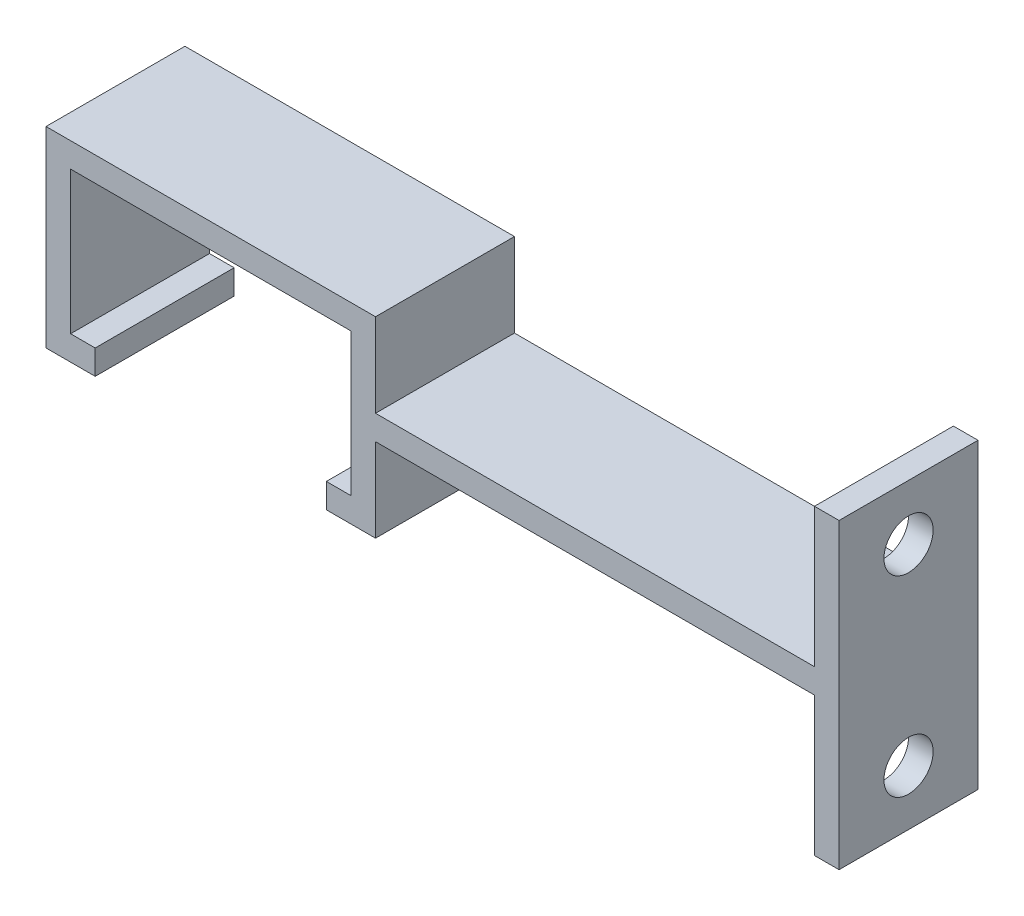
ISO-10303-21;
HEADER;
FILE_DESCRIPTION(('STEP AP214'),'2;1');
FILE_NAME('part.step','',(''),(''),'','','');
FILE_SCHEMA(('AUTOMOTIVE_DESIGN { 1 0 10303 214 1 1 1 1 }'));
ENDSEC;
DATA;
#1=APPLICATION_CONTEXT('core data for automotive mechanical design processes');
#2=APPLICATION_PROTOCOL_DEFINITION('international standard','automotive_design',2000,#1);
#3=PRODUCT_CONTEXT('',#1,'mechanical');
#4=PRODUCT('Part','Part','',(#3));
#5=PRODUCT_RELATED_PRODUCT_CATEGORY('part','',(#4));
#6=PRODUCT_DEFINITION_FORMATION('','',#4);
#7=PRODUCT_DEFINITION_CONTEXT('part definition',#1,'design');
#8=PRODUCT_DEFINITION('design','',#6,#7);
#9=PRODUCT_DEFINITION_SHAPE('','',#8);
#10=(LENGTH_UNIT() NAMED_UNIT(*) SI_UNIT(.MILLI.,.METRE.));
#11=(NAMED_UNIT(*) PLANE_ANGLE_UNIT() SI_UNIT($,.RADIAN.));
#12=(NAMED_UNIT(*) SI_UNIT($,.STERADIAN.) SOLID_ANGLE_UNIT());
#13=UNCERTAINTY_MEASURE_WITH_UNIT(LENGTH_MEASURE(1.E-05),#10,'distance_accuracy_value','');
#14=(GEOMETRIC_REPRESENTATION_CONTEXT(3) GLOBAL_UNCERTAINTY_ASSIGNED_CONTEXT((#13)) GLOBAL_UNIT_ASSIGNED_CONTEXT((#10,
#11,#12)) REPRESENTATION_CONTEXT('',''));
#15=CARTESIAN_POINT('',(0.,0.,0.));
#16=DIRECTION('',(0.,0.,1.));
#17=DIRECTION('',(1.,0.,0.));
#18=AXIS2_PLACEMENT_3D('',#15,#16,#17);
#19=CARTESIAN_POINT('',(0.,5.8,0.));
#20=DIRECTION('',(0.,1.,0.));
#21=DIRECTION('',(0.,0.,1.));
#22=AXIS2_PLACEMENT_3D('',#19,#20,#21);
#23=PLANE('',#22);
#24=DIRECTION('',(0.,0.,1.));
#25=VECTOR('',#24,1.);
#26=CARTESIAN_POINT('',(1.,5.8,11.3));
#27=LINE('',#26,#25);
#28=CARTESIAN_POINT('',(1.,5.8,0.));
#29=VERTEX_POINT('',#28);
#30=CARTESIAN_POINT('',(1.,5.8,11.3));
#31=VERTEX_POINT('',#30);
#32=EDGE_CURVE('E236',#29,#31,#27,.T.);
#33=ORIENTED_EDGE('',*,*,#32,.F.);
#34=DIRECTION('',(1.,0.,0.));
#35=VECTOR('',#34,1.);
#36=CARTESIAN_POINT('',(2.,5.8,0.));
#37=LINE('',#36,#35);
#38=CARTESIAN_POINT('',(36.7,5.8,0.));
#39=VERTEX_POINT('',#38);
#40=EDGE_CURVE('E187',#29,#39,#37,.T.);
#41=ORIENTED_EDGE('',*,*,#40,.T.);
#42=DIRECTION('',(0.,0.,-1.));
#43=VECTOR('',#42,1.);
#44=CARTESIAN_POINT('',(36.7,5.8,0.));
#45=LINE('',#44,#43);
#46=CARTESIAN_POINT('',(36.7,5.8,11.3));
#47=VERTEX_POINT('',#46);
#48=EDGE_CURVE('E262',#47,#39,#45,.T.);
#49=ORIENTED_EDGE('',*,*,#48,.F.);
#50=DIRECTION('',(-1.,0.,0.));
#51=VECTOR('',#50,1.);
#52=CARTESIAN_POINT('',(2.,5.8,11.3));
#53=LINE('',#52,#51);
#54=EDGE_CURVE('E63',#47,#31,#53,.T.);
#55=ORIENTED_EDGE('',*,*,#54,.T.);
#56=EDGE_LOOP('',(#33,#41,#49,#55));
#57=FACE_BOUND('',#56,.T.);
#58=ADVANCED_FACE('F38',(#57),#23,.F.);
#59=CARTESIAN_POINT('',(38.7,7.8,11.3));
#60=DIRECTION('',(0.,-1.,0.));
#61=DIRECTION('',(0.,0.,-1.));
#62=AXIS2_PLACEMENT_3D('',#59,#60,#61);
#63=PLANE('',#62);
#64=DIRECTION('',(0.,0.,1.));
#65=VECTOR('',#64,1.);
#66=CARTESIAN_POINT('',(36.7,7.8,11.3));
#67=LINE('',#66,#65);
#68=CARTESIAN_POINT('',(36.7,7.8,0.));
#69=VERTEX_POINT('',#68);
#70=CARTESIAN_POINT('',(36.7,7.8,11.3));
#71=VERTEX_POINT('',#70);
#72=EDGE_CURVE('E245',#69,#71,#67,.T.);
#73=ORIENTED_EDGE('',*,*,#72,.F.);
#74=DIRECTION('',(-1.,0.,0.));
#75=VECTOR('',#74,1.);
#76=CARTESIAN_POINT('',(38.7,7.8,0.));
#77=LINE('',#76,#75);
#78=CARTESIAN_POINT('',(1.,7.8,0.));
#79=VERTEX_POINT('',#78);
#80=EDGE_CURVE('E285',#69,#79,#77,.T.);
#81=ORIENTED_EDGE('',*,*,#80,.T.);
#82=DIRECTION('',(0.,0.,-1.));
#83=VECTOR('',#82,1.);
#84=CARTESIAN_POINT('',(1.,7.8,0.));
#85=LINE('',#84,#83);
#86=CARTESIAN_POINT('',(1.,7.8,11.3));
#87=VERTEX_POINT('',#86);
#88=EDGE_CURVE('E231',#87,#79,#85,.T.);
#89=ORIENTED_EDGE('',*,*,#88,.F.);
#90=DIRECTION('',(-1.,0.,0.));
#91=VECTOR('',#90,1.);
#92=CARTESIAN_POINT('',(38.7,7.8,11.3));
#93=LINE('',#92,#91);
#94=EDGE_CURVE('E283',#71,#87,#93,.T.);
#95=ORIENTED_EDGE('',*,*,#94,.F.);
#96=EDGE_LOOP('',(#73,#81,#89,#95));
#97=FACE_BOUND('',#96,.T.);
#98=ADVANCED_FACE('F361',(#97),#63,.F.);
#99=CARTESIAN_POINT('',(-21.8,0.999999999999997,11.3));
#100=DIRECTION('',(-1.,0.,0.));
#101=DIRECTION('',(0.,0.,1.));
#102=AXIS2_PLACEMENT_3D('',#99,#100,#101);
#103=PLANE('',#102);
#104=DIRECTION('',(0.,1.,0.));
#105=VECTOR('',#104,1.);
#106=CARTESIAN_POINT('',(-21.8,0.999999999999997,0.));
#107=LINE('',#106,#105);
#108=CARTESIAN_POINT('',(-21.8,-1.,0.));
#109=VERTEX_POINT('',#108);
#110=CARTESIAN_POINT('',(-21.8,0.999999999999997,0.));
#111=VERTEX_POINT('',#110);
#112=EDGE_CURVE('E294',#109,#111,#107,.T.);
#113=ORIENTED_EDGE('',*,*,#112,.T.);
#114=DIRECTION('',(0.,0.,-1.));
#115=VECTOR('',#114,1.);
#116=CARTESIAN_POINT('',(-21.8,0.999999999999997,11.3));
#117=LINE('',#116,#115);
#118=CARTESIAN_POINT('',(-21.8,0.999999999999997,11.3));
#119=VERTEX_POINT('',#118);
#120=EDGE_CURVE('E11',#119,#111,#117,.T.);
#121=ORIENTED_EDGE('',*,*,#120,.F.);
#122=DIRECTION('',(0.,1.,0.));
#123=VECTOR('',#122,1.);
#124=CARTESIAN_POINT('',(-21.8,0.999999999999997,11.3));
#125=LINE('',#124,#123);
#126=CARTESIAN_POINT('',(-21.8,-1.,11.3));
#127=VERTEX_POINT('',#126);
#128=EDGE_CURVE('E295',#127,#119,#125,.T.);
#129=ORIENTED_EDGE('',*,*,#128,.F.);
#130=DIRECTION('',(0.,0.,1.));
#131=VECTOR('',#130,1.);
#132=CARTESIAN_POINT('',(-21.8,-1.,0.));
#133=LINE('',#132,#131);
#134=EDGE_CURVE('E216',#109,#127,#133,.T.);
#135=ORIENTED_EDGE('',*,*,#134,.F.);
#136=EDGE_LOOP('',(#113,#121,#129,#135));
#137=FACE_BOUND('',#136,.T.);
#138=ADVANCED_FACE('F40',(#137),#103,.F.);
#139=CARTESIAN_POINT('',(-23.8,0.999999999999997,11.3));
#140=DIRECTION('',(0.,-1.,0.));
#141=DIRECTION('',(1.,0.,0.));
#142=AXIS2_PLACEMENT_3D('',#139,#140,#141);
#143=PLANE('',#142);
#144=DIRECTION('',(-1.,0.,0.));
#145=VECTOR('',#144,1.);
#146=CARTESIAN_POINT('',(-23.8,0.999999999999997,0.));
#147=LINE('',#146,#145);
#148=CARTESIAN_POINT('',(-23.8,0.999999999999997,0.));
#149=VERTEX_POINT('',#148);
#150=EDGE_CURVE('E312',#111,#149,#147,.T.);
#151=ORIENTED_EDGE('',*,*,#150,.T.);
#152=DIRECTION('',(0.,0.,-1.));
#153=VECTOR('',#152,1.);
#154=CARTESIAN_POINT('',(-23.8,0.999999999999997,11.3));
#155=LINE('',#154,#153);
#156=CARTESIAN_POINT('',(-23.8,0.999999999999997,11.3));
#157=VERTEX_POINT('',#156);
#158=EDGE_CURVE('E47',#157,#149,#155,.T.);
#159=ORIENTED_EDGE('',*,*,#158,.F.);
#160=DIRECTION('',(-1.,0.,0.));
#161=VECTOR('',#160,1.);
#162=CARTESIAN_POINT('',(-23.8,0.999999999999997,11.3));
#163=LINE('',#162,#161);
#164=EDGE_CURVE('E297',#119,#157,#163,.T.);
#165=ORIENTED_EDGE('',*,*,#164,.F.);
#166=ORIENTED_EDGE('',*,*,#120,.T.);
#167=EDGE_LOOP('',(#151,#159,#165,#166));
#168=FACE_BOUND('',#167,.T.);
#169=ADVANCED_FACE('F399',(#168),#143,.F.);
#170=CARTESIAN_POINT('',(-23.8,12.6,11.3));
#171=DIRECTION('',(-1.,0.,0.));
#172=DIRECTION('',(0.,0.,1.));
#173=AXIS2_PLACEMENT_3D('',#170,#171,#172);
#174=PLANE('',#173);
#175=DIRECTION('',(0.,1.,0.));
#176=VECTOR('',#175,1.);
#177=CARTESIAN_POINT('',(-23.8,12.6,0.));
#178=LINE('',#177,#176);
#179=CARTESIAN_POINT('',(-23.8,12.6,0.));
#180=VERTEX_POINT('',#179);
#181=EDGE_CURVE('E314',#149,#180,#178,.T.);
#182=ORIENTED_EDGE('',*,*,#181,.T.);
#183=DIRECTION('',(0.,0.,-1.));
#184=VECTOR('',#183,1.);
#185=CARTESIAN_POINT('',(-23.8,12.6,11.3));
#186=LINE('',#185,#184);
#187=CARTESIAN_POINT('',(-23.8,12.6,11.3));
#188=VERTEX_POINT('',#187);
#189=EDGE_CURVE('E331',#188,#180,#186,.T.);
#190=ORIENTED_EDGE('',*,*,#189,.F.);
#191=DIRECTION('',(0.,1.,0.));
#192=VECTOR('',#191,1.);
#193=CARTESIAN_POINT('',(-23.8,12.6,11.3));
#194=LINE('',#193,#192);
#195=EDGE_CURVE('E300',#157,#188,#194,.T.);
#196=ORIENTED_EDGE('',*,*,#195,.F.);
#197=ORIENTED_EDGE('',*,*,#158,.T.);
#198=EDGE_LOOP('',(#182,#190,#196,#197));
#199=FACE_BOUND('',#198,.T.);
#200=ADVANCED_FACE('F396',(#199),#174,.F.);
#201=CARTESIAN_POINT('',(-23.8,12.6,11.3));
#202=DIRECTION('',(0.,1.,0.));
#203=DIRECTION('',(0.,0.,1.));
#204=AXIS2_PLACEMENT_3D('',#201,#202,#203);
#205=PLANE('',#204);
#206=DIRECTION('',(1.,0.,0.));
#207=VECTOR('',#206,1.);
#208=CARTESIAN_POINT('',(-23.8,12.6,0.));
#209=LINE('',#208,#207);
#210=CARTESIAN_POINT('',(-1.,12.6,0.));
#211=VERTEX_POINT('',#210);
#212=EDGE_CURVE('E316',#180,#211,#209,.T.);
#213=ORIENTED_EDGE('',*,*,#212,.T.);
#214=DIRECTION('',(0.,0.,-1.));
#215=VECTOR('',#214,1.);
#216=CARTESIAN_POINT('',(-1.,12.6,11.3));
#217=LINE('',#216,#215);
#218=CARTESIAN_POINT('',(-1.,12.6,11.3));
#219=VERTEX_POINT('',#218);
#220=EDGE_CURVE('E328',#219,#211,#217,.T.);
#221=ORIENTED_EDGE('',*,*,#220,.F.);
#222=DIRECTION('',(1.,0.,0.));
#223=VECTOR('',#222,1.);
#224=CARTESIAN_POINT('',(-23.8,12.6,11.3));
#225=LINE('',#224,#223);
#226=EDGE_CURVE('E302',#188,#219,#225,.T.);
#227=ORIENTED_EDGE('',*,*,#226,.F.);
#228=ORIENTED_EDGE('',*,*,#189,.T.);
#229=EDGE_LOOP('',(#213,#221,#227,#228));
#230=FACE_BOUND('',#229,.T.);
#231=ADVANCED_FACE('F392',(#230),#205,.F.);
#232=CARTESIAN_POINT('',(-1.,12.6,11.3));
#233=DIRECTION('',(1.,0.,0.));
#234=DIRECTION('',(0.,0.,-1.));
#235=AXIS2_PLACEMENT_3D('',#232,#233,#234);
#236=PLANE('',#235);
#237=DIRECTION('',(0.,-1.,0.));
#238=VECTOR('',#237,1.);
#239=CARTESIAN_POINT('',(-1.,12.6,0.));
#240=LINE('',#239,#238);
#241=CARTESIAN_POINT('',(-1.,0.999999999999997,0.));
#242=VERTEX_POINT('',#241);
#243=EDGE_CURVE('E318',#211,#242,#240,.T.);
#244=ORIENTED_EDGE('',*,*,#243,.T.);
#245=DIRECTION('',(0.,0.,-1.));
#246=VECTOR('',#245,1.);
#247=CARTESIAN_POINT('',(-1.,0.999999999999997,11.3));
#248=LINE('',#247,#246);
#249=CARTESIAN_POINT('',(-1.,0.999999999999997,11.3));
#250=VERTEX_POINT('',#249);
#251=EDGE_CURVE('E325',#250,#242,#248,.T.);
#252=ORIENTED_EDGE('',*,*,#251,.F.);
#253=DIRECTION('',(0.,-1.,0.));
#254=VECTOR('',#253,1.);
#255=CARTESIAN_POINT('',(-1.,12.6,11.3));
#256=LINE('',#255,#254);
#257=EDGE_CURVE('E304',#219,#250,#256,.T.);
#258=ORIENTED_EDGE('',*,*,#257,.F.);
#259=ORIENTED_EDGE('',*,*,#220,.T.);
#260=EDGE_LOOP('',(#244,#252,#258,#259));
#261=FACE_BOUND('',#260,.T.);
#262=ADVANCED_FACE('F388',(#261),#236,.F.);
#263=CARTESIAN_POINT('',(-3.,0.999999999999997,11.3));
#264=DIRECTION('',(0.,-1.,0.));
#265=DIRECTION('',(1.,0.,0.));
#266=AXIS2_PLACEMENT_3D('',#263,#264,#265);
#267=PLANE('',#266);
#268=DIRECTION('',(-1.,0.,0.));
#269=VECTOR('',#268,1.);
#270=CARTESIAN_POINT('',(-3.,0.999999999999997,0.));
#271=LINE('',#270,#269);
#272=CARTESIAN_POINT('',(-3.,0.999999999999997,0.));
#273=VERTEX_POINT('',#272);
#274=EDGE_CURVE('E320',#242,#273,#271,.T.);
#275=ORIENTED_EDGE('',*,*,#274,.T.);
#276=DIRECTION('',(0.,0.,-1.));
#277=VECTOR('',#276,1.);
#278=CARTESIAN_POINT('',(-3.,0.999999999999997,11.3));
#279=LINE('',#278,#277);
#280=CARTESIAN_POINT('',(-3.,0.999999999999997,11.3));
#281=VERTEX_POINT('',#280);
#282=EDGE_CURVE('E310',#281,#273,#279,.T.);
#283=ORIENTED_EDGE('',*,*,#282,.F.);
#284=DIRECTION('',(-1.,0.,0.));
#285=VECTOR('',#284,1.);
#286=CARTESIAN_POINT('',(-3.,0.999999999999997,11.3));
#287=LINE('',#286,#285);
#288=EDGE_CURVE('E306',#250,#281,#287,.T.);
#289=ORIENTED_EDGE('',*,*,#288,.F.);
#290=ORIENTED_EDGE('',*,*,#251,.T.);
#291=EDGE_LOOP('',(#275,#283,#289,#290));
#292=FACE_BOUND('',#291,.T.);
#293=ADVANCED_FACE('F384',(#292),#267,.F.);
#294=CARTESIAN_POINT('',(-3.,0.999999999999997,11.3));
#295=DIRECTION('',(1.,0.,0.));
#296=DIRECTION('',(0.,0.,-1.));
#297=AXIS2_PLACEMENT_3D('',#294,#295,#296);
#298=PLANE('',#297);
#299=DIRECTION('',(0.,-1.,0.));
#300=VECTOR('',#299,1.);
#301=CARTESIAN_POINT('',(-3.,0.999999999999997,0.));
#302=LINE('',#301,#300);
#303=CARTESIAN_POINT('',(-3.,-1.,0.));
#304=VERTEX_POINT('',#303);
#305=EDGE_CURVE('E298',#273,#304,#302,.T.);
#306=ORIENTED_EDGE('',*,*,#305,.T.);
#307=DIRECTION('',(0.,0.,1.));
#308=VECTOR('',#307,1.);
#309=CARTESIAN_POINT('',(-3.,-1.,0.));
#310=LINE('',#309,#308);
#311=CARTESIAN_POINT('',(-3.,-1.,11.3));
#312=VERTEX_POINT('',#311);
#313=EDGE_CURVE('E199',#304,#312,#310,.T.);
#314=ORIENTED_EDGE('',*,*,#313,.T.);
#315=DIRECTION('',(0.,-1.,0.));
#316=VECTOR('',#315,1.);
#317=CARTESIAN_POINT('',(-3.,0.999999999999997,11.3));
#318=LINE('',#317,#316);
#319=EDGE_CURVE('E308',#281,#312,#318,.T.);
#320=ORIENTED_EDGE('',*,*,#319,.F.);
#321=ORIENTED_EDGE('',*,*,#282,.T.);
#322=EDGE_LOOP('',(#306,#314,#320,#321));
#323=FACE_BOUND('',#322,.T.);
#324=ADVANCED_FACE('F378',(#323),#298,.F.);
#325=CARTESIAN_POINT('',(0.,0.,11.3));
#326=DIRECTION('',(0.,0.,1.));
#327=DIRECTION('',(1.,0.,0.));
#328=AXIS2_PLACEMENT_3D('',#325,#326,#327);
#329=PLANE('',#328);
#330=ORIENTED_EDGE('',*,*,#94,.T.);
#331=DIRECTION('',(0.,-1.,0.));
#332=VECTOR('',#331,1.);
#333=CARTESIAN_POINT('',(1.,7.8,11.3));
#334=LINE('',#333,#332);
#335=CARTESIAN_POINT('',(1.,14.6,11.3));
#336=VERTEX_POINT('',#335);
#337=EDGE_CURVE('E228',#336,#87,#334,.T.);
#338=ORIENTED_EDGE('',*,*,#337,.F.);
#339=DIRECTION('',(1.,0.,0.));
#340=VECTOR('',#339,1.);
#341=CARTESIAN_POINT('',(-16.8,14.6,11.3));
#342=LINE('',#341,#340);
#343=CARTESIAN_POINT('',(-25.8,14.6,11.3));
#344=VERTEX_POINT('',#343);
#345=EDGE_CURVE('E289',#344,#336,#342,.T.);
#346=ORIENTED_EDGE('',*,*,#345,.F.);
#347=DIRECTION('',(0.,-1.,0.));
#348=VECTOR('',#347,1.);
#349=CARTESIAN_POINT('',(-25.8,14.6,11.3));
#350=LINE('',#349,#348);
#351=CARTESIAN_POINT('',(-25.8,-1.,11.3));
#352=VERTEX_POINT('',#351);
#353=EDGE_CURVE('E189',#344,#352,#350,.T.);
#354=ORIENTED_EDGE('',*,*,#353,.T.);
#355=DIRECTION('',(1.,0.,0.));
#356=VECTOR('',#355,1.);
#357=CARTESIAN_POINT('',(-21.8,-1.,11.3));
#358=LINE('',#357,#356);
#359=EDGE_CURVE('E208',#352,#127,#358,.T.);
#360=ORIENTED_EDGE('',*,*,#359,.T.);
#361=ORIENTED_EDGE('',*,*,#128,.T.);
#362=ORIENTED_EDGE('',*,*,#164,.T.);
#363=ORIENTED_EDGE('',*,*,#195,.T.);
#364=ORIENTED_EDGE('',*,*,#226,.T.);
#365=ORIENTED_EDGE('',*,*,#257,.T.);
#366=ORIENTED_EDGE('',*,*,#288,.T.);
#367=ORIENTED_EDGE('',*,*,#319,.T.);
#368=DIRECTION('',(1.,0.,0.));
#369=VECTOR('',#368,1.);
#370=CARTESIAN_POINT('',(1.,-1.,11.3));
#371=LINE('',#370,#369);
#372=CARTESIAN_POINT('',(1.,-1.,11.3));
#373=VERTEX_POINT('',#372);
#374=EDGE_CURVE('E204',#312,#373,#371,.T.);
#375=ORIENTED_EDGE('',*,*,#374,.T.);
#376=DIRECTION('',(0.,1.,0.));
#377=VECTOR('',#376,1.);
#378=CARTESIAN_POINT('',(1.,0.,11.3));
#379=LINE('',#378,#377);
#380=EDGE_CURVE('E190',#373,#31,#379,.T.);
#381=ORIENTED_EDGE('',*,*,#380,.T.);
#382=ORIENTED_EDGE('',*,*,#54,.F.);
#383=DIRECTION('',(0.,1.,0.));
#384=VECTOR('',#383,1.);
#385=CARTESIAN_POINT('',(36.7,-5.5,11.3));
#386=LINE('',#385,#384);
#387=CARTESIAN_POINT('',(36.7,-5.5,11.3));
#388=VERTEX_POINT('',#387);
#389=EDGE_CURVE('E277',#388,#47,#386,.T.);
#390=ORIENTED_EDGE('',*,*,#389,.F.);
#391=DIRECTION('',(-1.,0.,0.));
#392=VECTOR('',#391,1.);
#393=CARTESIAN_POINT('',(38.7,-5.5,11.3));
#394=LINE('',#393,#392);
#395=CARTESIAN_POINT('',(38.7,-5.5,11.3));
#396=VERTEX_POINT('',#395);
#397=EDGE_CURVE('E266',#396,#388,#394,.T.);
#398=ORIENTED_EDGE('',*,*,#397,.F.);
#399=DIRECTION('',(0.,-1.,0.));
#400=VECTOR('',#399,1.);
#401=CARTESIAN_POINT('',(38.7,5.8,11.3));
#402=LINE('',#401,#400);
#403=CARTESIAN_POINT('',(38.7,19.1,11.3));
#404=VERTEX_POINT('',#403);
#405=EDGE_CURVE('E279',#404,#396,#402,.T.);
#406=ORIENTED_EDGE('',*,*,#405,.F.);
#407=DIRECTION('',(1.,0.,0.));
#408=VECTOR('',#407,1.);
#409=CARTESIAN_POINT('',(38.7,19.1,11.3));
#410=LINE('',#409,#408);
#411=CARTESIAN_POINT('',(36.7,19.1,11.3));
#412=VERTEX_POINT('',#411);
#413=EDGE_CURVE('E253',#412,#404,#410,.T.);
#414=ORIENTED_EDGE('',*,*,#413,.F.);
#415=DIRECTION('',(0.,-1.,0.));
#416=VECTOR('',#415,1.);
#417=CARTESIAN_POINT('',(36.7,19.1,11.3));
#418=LINE('',#417,#416);
#419=EDGE_CURVE('E256',#412,#71,#418,.T.);
#420=ORIENTED_EDGE('',*,*,#419,.T.);
#421=EDGE_LOOP('',(#330,#338,#346,#354,#360,#361,#362,#363,#364,#365,#366,#367,#375,#381,#382,
#390,#398,#406,#414,#420));
#422=FACE_BOUND('',#421,.T.);
#423=ADVANCED_FACE('F375',(#422),#329,.T.);
#424=CARTESIAN_POINT('',(0.,0.,0.));
#425=DIRECTION('',(0.,0.,1.));
#426=DIRECTION('',(1.,0.,0.));
#427=AXIS2_PLACEMENT_3D('',#424,#425,#426);
#428=PLANE('',#427);
#429=DIRECTION('',(0.,1.,0.));
#430=VECTOR('',#429,1.);
#431=CARTESIAN_POINT('',(1.,14.6,0.));
#432=LINE('',#431,#430);
#433=CARTESIAN_POINT('',(1.,14.6,0.));
#434=VERTEX_POINT('',#433);
#435=EDGE_CURVE('E55',#79,#434,#432,.T.);
#436=ORIENTED_EDGE('',*,*,#435,.F.);
#437=ORIENTED_EDGE('',*,*,#80,.F.);
#438=DIRECTION('',(0.,-1.,0.));
#439=VECTOR('',#438,1.);
#440=CARTESIAN_POINT('',(36.7,19.1,0.));
#441=LINE('',#440,#439);
#442=CARTESIAN_POINT('',(36.7,19.1,0.));
#443=VERTEX_POINT('',#442);
#444=EDGE_CURVE('E260',#443,#69,#441,.T.);
#445=ORIENTED_EDGE('',*,*,#444,.F.);
#446=DIRECTION('',(-1.,0.,0.));
#447=VECTOR('',#446,1.);
#448=CARTESIAN_POINT('',(38.7,19.1,0.));
#449=LINE('',#448,#447);
#450=CARTESIAN_POINT('',(38.7,19.1,0.));
#451=VERTEX_POINT('',#450);
#452=EDGE_CURVE('E249',#451,#443,#449,.T.);
#453=ORIENTED_EDGE('',*,*,#452,.F.);
#454=DIRECTION('',(0.,1.,0.));
#455=VECTOR('',#454,1.);
#456=CARTESIAN_POINT('',(38.7,5.8,0.));
#457=LINE('',#456,#455);
#458=CARTESIAN_POINT('',(38.7,-5.5,0.));
#459=VERTEX_POINT('',#458);
#460=EDGE_CURVE('E281',#459,#451,#457,.T.);
#461=ORIENTED_EDGE('',*,*,#460,.F.);
#462=DIRECTION('',(1.,0.,0.));
#463=VECTOR('',#462,1.);
#464=CARTESIAN_POINT('',(38.7,-5.5,0.));
#465=LINE('',#464,#463);
#466=CARTESIAN_POINT('',(36.7,-5.5,0.));
#467=VERTEX_POINT('',#466);
#468=EDGE_CURVE('E270',#467,#459,#465,.T.);
#469=ORIENTED_EDGE('',*,*,#468,.F.);
#470=DIRECTION('',(0.,1.,0.));
#471=VECTOR('',#470,1.);
#472=CARTESIAN_POINT('',(36.7,-5.5,0.));
#473=LINE('',#472,#471);
#474=EDGE_CURVE('E273',#467,#39,#473,.T.);
#475=ORIENTED_EDGE('',*,*,#474,.T.);
#476=ORIENTED_EDGE('',*,*,#40,.F.);
#477=DIRECTION('',(0.,1.,0.));
#478=VECTOR('',#477,1.);
#479=CARTESIAN_POINT('',(1.,0.,0.));
#480=LINE('',#479,#478);
#481=CARTESIAN_POINT('',(1.,-1.,0.));
#482=VERTEX_POINT('',#481);
#483=EDGE_CURVE('E180',#482,#29,#480,.T.);
#484=ORIENTED_EDGE('',*,*,#483,.F.);
#485=DIRECTION('',(1.,0.,0.));
#486=VECTOR('',#485,1.);
#487=CARTESIAN_POINT('',(1.,-1.,0.));
#488=LINE('',#487,#486);
#489=EDGE_CURVE('E185',#304,#482,#488,.T.);
#490=ORIENTED_EDGE('',*,*,#489,.F.);
#491=ORIENTED_EDGE('',*,*,#305,.F.);
#492=ORIENTED_EDGE('',*,*,#274,.F.);
#493=ORIENTED_EDGE('',*,*,#243,.F.);
#494=ORIENTED_EDGE('',*,*,#212,.F.);
#495=ORIENTED_EDGE('',*,*,#181,.F.);
#496=ORIENTED_EDGE('',*,*,#150,.F.);
#497=ORIENTED_EDGE('',*,*,#112,.F.);
#498=DIRECTION('',(1.,0.,0.));
#499=VECTOR('',#498,1.);
#500=CARTESIAN_POINT('',(-21.8,-1.,0.));
#501=LINE('',#500,#499);
#502=CARTESIAN_POINT('',(-25.8,-1.,0.));
#503=VERTEX_POINT('',#502);
#504=EDGE_CURVE('E210',#503,#109,#501,.T.);
#505=ORIENTED_EDGE('',*,*,#504,.F.);
#506=DIRECTION('',(0.,-1.,0.));
#507=VECTOR('',#506,1.);
#508=CARTESIAN_POINT('',(-25.8,14.6,0.));
#509=LINE('',#508,#507);
#510=CARTESIAN_POINT('',(-25.8,14.6,0.));
#511=VERTEX_POINT('',#510);
#512=EDGE_CURVE('E239',#511,#503,#509,.T.);
#513=ORIENTED_EDGE('',*,*,#512,.F.);
#514=DIRECTION('',(-1.,0.,0.));
#515=VECTOR('',#514,1.);
#516=CARTESIAN_POINT('',(-16.8,14.6,0.));
#517=LINE('',#516,#515);
#518=EDGE_CURVE('E292',#434,#511,#517,.T.);
#519=ORIENTED_EDGE('',*,*,#518,.F.);
#520=EDGE_LOOP('',(#436,#437,#445,#453,#461,#469,#475,#476,#484,#490,#491,#492,#493,#494,#495,
#496,#497,#505,#513,#519));
#521=FACE_BOUND('',#520,.T.);
#522=ADVANCED_FACE('F182',(#521),#428,.F.);
#523=CARTESIAN_POINT('',(0.,14.6,0.));
#524=DIRECTION('',(0.,1.,0.));
#525=DIRECTION('',(-1.,0.,0.));
#526=AXIS2_PLACEMENT_3D('',#523,#524,#525);
#527=PLANE('',#526);
#528=DIRECTION('',(0.,0.,1.));
#529=VECTOR('',#528,1.);
#530=CARTESIAN_POINT('',(1.,14.6,11.3));
#531=LINE('',#530,#529);
#532=EDGE_CURVE('E234',#434,#336,#531,.T.);
#533=ORIENTED_EDGE('',*,*,#532,.F.);
#534=ORIENTED_EDGE('',*,*,#518,.T.);
#535=DIRECTION('',(0.,0.,1.));
#536=VECTOR('',#535,1.);
#537=CARTESIAN_POINT('',(-25.8,14.6,0.));
#538=LINE('',#537,#536);
#539=EDGE_CURVE('E241',#511,#344,#538,.T.);
#540=ORIENTED_EDGE('',*,*,#539,.T.);
#541=ORIENTED_EDGE('',*,*,#345,.T.);
#542=EDGE_LOOP('',(#533,#534,#540,#541));
#543=FACE_BOUND('',#542,.T.);
#544=ADVANCED_FACE('F370',(#543),#527,.T.);
#545=CARTESIAN_POINT('',(38.7,0.,0.));
#546=DIRECTION('',(-1.,0.,0.));
#547=DIRECTION('',(0.,0.,1.));
#548=AXIS2_PLACEMENT_3D('',#545,#546,#547);
#549=PLANE('',#548);
#550=CARTESIAN_POINT('',(38.7,14.6,5.65));
#551=DIRECTION('',(1.,0.,0.));
#552=DIRECTION('',(0.,0.,-1.));
#553=AXIS2_PLACEMENT_3D('',#550,#551,#552);
#554=CIRCLE('',#553,2.);
#555=CARTESIAN_POINT('',(38.7,14.6,3.65));
#556=VERTEX_POINT('',#555);
#557=EDGE_CURVE('E222',#556,#556,#554,.T.);
#558=ORIENTED_EDGE('',*,*,#557,.F.);
#559=EDGE_LOOP('',(#558));
#560=FACE_BOUND('',#559,.T.);
#561=CARTESIAN_POINT('',(38.7,-1.,5.64999999999999));
#562=DIRECTION('',(1.,0.,0.));
#563=DIRECTION('',(0.,0.,1.));
#564=AXIS2_PLACEMENT_3D('',#561,#562,#563);
#565=CIRCLE('',#564,2.);
#566=CARTESIAN_POINT('',(38.7,-1.,7.64999999999999));
#567=VERTEX_POINT('',#566);
#568=EDGE_CURVE('E219',#567,#567,#565,.T.);
#569=ORIENTED_EDGE('',*,*,#568,.F.);
#570=EDGE_LOOP('',(#569));
#571=FACE_BOUND('',#570,.T.);
#572=ORIENTED_EDGE('',*,*,#405,.T.);
#573=DIRECTION('',(0.,0.,1.));
#574=VECTOR('',#573,1.);
#575=CARTESIAN_POINT('',(38.7,-5.5,0.));
#576=LINE('',#575,#574);
#577=EDGE_CURVE('E263',#459,#396,#576,.T.);
#578=ORIENTED_EDGE('',*,*,#577,.F.);
#579=ORIENTED_EDGE('',*,*,#460,.T.);
#580=DIRECTION('',(0.,0.,-1.));
#581=VECTOR('',#580,1.);
#582=CARTESIAN_POINT('',(38.7,19.1,11.3));
#583=LINE('',#582,#581);
#584=EDGE_CURVE('E246',#404,#451,#583,.T.);
#585=ORIENTED_EDGE('',*,*,#584,.F.);
#586=EDGE_LOOP('',(#572,#578,#579,#585));
#587=FACE_BOUND('',#586,.T.);
#588=ADVANCED_FACE('F373',(#560,#571,#587),#549,.F.);
#589=CARTESIAN_POINT('',(36.7,-5.5,0.));
#590=DIRECTION('',(1.,0.,0.));
#591=DIRECTION('',(0.,0.,-1.));
#592=AXIS2_PLACEMENT_3D('',#589,#590,#591);
#593=PLANE('',#592);
#594=CARTESIAN_POINT('',(36.7,-1.,5.64999999999999));
#595=DIRECTION('',(1.,0.,0.));
#596=DIRECTION('',(0.,0.,-1.));
#597=AXIS2_PLACEMENT_3D('',#594,#595,#596);
#598=CIRCLE('',#597,2.);
#599=CARTESIAN_POINT('',(36.7,-1.,3.64999999999999));
#600=VERTEX_POINT('',#599);
#601=EDGE_CURVE('E42',#600,#600,#598,.T.);
#602=ORIENTED_EDGE('',*,*,#601,.T.);
#603=EDGE_LOOP('',(#602));
#604=FACE_BOUND('',#603,.T.);
#605=ORIENTED_EDGE('',*,*,#48,.T.);
#606=ORIENTED_EDGE('',*,*,#474,.F.);
#607=DIRECTION('',(0.,0.,-1.));
#608=VECTOR('',#607,1.);
#609=CARTESIAN_POINT('',(36.7,-5.5,0.));
#610=LINE('',#609,#608);
#611=EDGE_CURVE('E268',#388,#467,#610,.T.);
#612=ORIENTED_EDGE('',*,*,#611,.F.);
#613=ORIENTED_EDGE('',*,*,#389,.T.);
#614=EDGE_LOOP('',(#605,#606,#612,#613));
#615=FACE_BOUND('',#614,.T.);
#616=ADVANCED_FACE('F341',(#604,#615),#593,.F.);
#617=CARTESIAN_POINT('',(0.,-5.5,0.));
#618=DIRECTION('',(0.,-1.,0.));
#619=DIRECTION('',(0.,0.,-1.));
#620=AXIS2_PLACEMENT_3D('',#617,#618,#619);
#621=PLANE('',#620);
#622=ORIENTED_EDGE('',*,*,#577,.T.);
#623=ORIENTED_EDGE('',*,*,#397,.T.);
#624=ORIENTED_EDGE('',*,*,#611,.T.);
#625=ORIENTED_EDGE('',*,*,#468,.T.);
#626=EDGE_LOOP('',(#622,#623,#624,#625));
#627=FACE_BOUND('',#626,.T.);
#628=ADVANCED_FACE('F452',(#627),#621,.T.);
#629=CARTESIAN_POINT('',(36.7,19.1,11.3));
#630=DIRECTION('',(1.,0.,0.));
#631=DIRECTION('',(0.,0.,-1.));
#632=AXIS2_PLACEMENT_3D('',#629,#630,#631);
#633=PLANE('',#632);
#634=CARTESIAN_POINT('',(36.7,14.6,5.65));
#635=DIRECTION('',(1.,0.,0.));
#636=DIRECTION('',(0.,0.,-1.));
#637=AXIS2_PLACEMENT_3D('',#634,#635,#636);
#638=CIRCLE('',#637,2.);
#639=CARTESIAN_POINT('',(36.7,14.6,3.65));
#640=VERTEX_POINT('',#639);
#641=EDGE_CURVE('E225',#640,#640,#638,.T.);
#642=ORIENTED_EDGE('',*,*,#641,.T.);
#643=EDGE_LOOP('',(#642));
#644=FACE_BOUND('',#643,.T.);
#645=ORIENTED_EDGE('',*,*,#72,.T.);
#646=ORIENTED_EDGE('',*,*,#419,.F.);
#647=DIRECTION('',(0.,0.,1.));
#648=VECTOR('',#647,1.);
#649=CARTESIAN_POINT('',(36.7,19.1,11.3));
#650=LINE('',#649,#648);
#651=EDGE_CURVE('E251',#443,#412,#650,.T.);
#652=ORIENTED_EDGE('',*,*,#651,.F.);
#653=ORIENTED_EDGE('',*,*,#444,.T.);
#654=EDGE_LOOP('',(#645,#646,#652,#653));
#655=FACE_BOUND('',#654,.T.);
#656=ADVANCED_FACE('F444',(#644,#655),#633,.F.);
#657=CARTESIAN_POINT('',(0.,19.1,0.));
#658=DIRECTION('',(0.,1.,0.));
#659=DIRECTION('',(0.,0.,1.));
#660=AXIS2_PLACEMENT_3D('',#657,#658,#659);
#661=PLANE('',#660);
#662=ORIENTED_EDGE('',*,*,#584,.T.);
#663=ORIENTED_EDGE('',*,*,#452,.T.);
#664=ORIENTED_EDGE('',*,*,#651,.T.);
#665=ORIENTED_EDGE('',*,*,#413,.T.);
#666=EDGE_LOOP('',(#662,#663,#664,#665));
#667=FACE_BOUND('',#666,.T.);
#668=ADVANCED_FACE('F446',(#667),#661,.T.);
#669=CARTESIAN_POINT('',(-25.8,14.6,0.));
#670=DIRECTION('',(-1.,0.,0.));
#671=DIRECTION('',(0.,-1.,0.));
#672=AXIS2_PLACEMENT_3D('',#669,#670,#671);
#673=PLANE('',#672);
#674=ORIENTED_EDGE('',*,*,#353,.F.);
#675=ORIENTED_EDGE('',*,*,#539,.F.);
#676=ORIENTED_EDGE('',*,*,#512,.T.);
#677=DIRECTION('',(0.,0.,1.));
#678=VECTOR('',#677,1.);
#679=CARTESIAN_POINT('',(-25.8,-1.,0.));
#680=LINE('',#679,#678);
#681=EDGE_CURVE('E213',#503,#352,#680,.T.);
#682=ORIENTED_EDGE('',*,*,#681,.T.);
#683=EDGE_LOOP('',(#674,#675,#676,#682));
#684=FACE_BOUND('',#683,.T.);
#685=ADVANCED_FACE('F431',(#684),#673,.T.);
#686=CARTESIAN_POINT('',(1.,0.,11.3));
#687=DIRECTION('',(-1.,0.,0.));
#688=DIRECTION('',(0.,0.,1.));
#689=AXIS2_PLACEMENT_3D('',#686,#687,#688);
#690=PLANE('',#689);
#691=ORIENTED_EDGE('',*,*,#32,.T.);
#692=ORIENTED_EDGE('',*,*,#380,.F.);
#693=DIRECTION('',(0.,0.,1.));
#694=VECTOR('',#693,1.);
#695=CARTESIAN_POINT('',(1.,-1.,0.));
#696=LINE('',#695,#694);
#697=EDGE_CURVE('E193',#482,#373,#696,.T.);
#698=ORIENTED_EDGE('',*,*,#697,.F.);
#699=ORIENTED_EDGE('',*,*,#483,.T.);
#700=EDGE_LOOP('',(#691,#692,#698,#699));
#701=FACE_BOUND('',#700,.T.);
#702=ADVANCED_FACE('F194',(#701),#690,.F.);
#703=CARTESIAN_POINT('',(1.,0.,0.));
#704=DIRECTION('',(-1.,0.,0.));
#705=DIRECTION('',(0.,0.,1.));
#706=AXIS2_PLACEMENT_3D('',#703,#704,#705);
#707=PLANE('',#706);
#708=ORIENTED_EDGE('',*,*,#337,.T.);
#709=ORIENTED_EDGE('',*,*,#88,.T.);
#710=ORIENTED_EDGE('',*,*,#435,.T.);
#711=ORIENTED_EDGE('',*,*,#532,.T.);
#712=EDGE_LOOP('',(#708,#709,#710,#711));
#713=FACE_BOUND('',#712,.T.);
#714=ADVANCED_FACE('F356',(#713),#707,.F.);
#715=CARTESIAN_POINT('',(28.7000000000001,14.6,5.65));
#716=DIRECTION('',(1.,0.,0.));
#717=DIRECTION('',(0.,0.,-1.));
#718=AXIS2_PLACEMENT_3D('',#715,#716,#717);
#719=CYLINDRICAL_SURFACE('',#718,2.);
#720=ORIENTED_EDGE('',*,*,#557,.T.);
#721=EDGE_LOOP('',(#720));
#722=FACE_BOUND('',#721,.T.);
#723=ORIENTED_EDGE('',*,*,#641,.F.);
#724=EDGE_LOOP('',(#723));
#725=FACE_BOUND('',#724,.T.);
#726=ADVANCED_FACE('F347',(#722,#725),#719,.F.);
#727=CARTESIAN_POINT('',(28.7000000000001,-1.,5.65));
#728=DIRECTION('',(1.,0.,0.));
#729=DIRECTION('',(0.,0.,-1.));
#730=AXIS2_PLACEMENT_3D('',#727,#728,#729);
#731=CYLINDRICAL_SURFACE('',#730,2.);
#732=ORIENTED_EDGE('',*,*,#568,.T.);
#733=EDGE_LOOP('',(#732));
#734=FACE_BOUND('',#733,.T.);
#735=ORIENTED_EDGE('',*,*,#601,.F.);
#736=EDGE_LOOP('',(#735));
#737=FACE_BOUND('',#736,.T.);
#738=ADVANCED_FACE('F344',(#734,#737),#731,.F.);
#739=CARTESIAN_POINT('',(-21.8,-1.,0.));
#740=DIRECTION('',(0.,-1.,0.));
#741=DIRECTION('',(1.,0.,0.));
#742=AXIS2_PLACEMENT_3D('',#739,#740,#741);
#743=PLANE('',#742);
#744=ORIENTED_EDGE('',*,*,#359,.F.);
#745=ORIENTED_EDGE('',*,*,#681,.F.);
#746=ORIENTED_EDGE('',*,*,#504,.T.);
#747=ORIENTED_EDGE('',*,*,#134,.T.);
#748=EDGE_LOOP('',(#744,#745,#746,#747));
#749=FACE_BOUND('',#748,.T.);
#750=ADVANCED_FACE('F346',(#749),#743,.T.);
#751=CARTESIAN_POINT('',(1.,-1.,0.));
#752=DIRECTION('',(0.,-1.,0.));
#753=DIRECTION('',(1.,0.,0.));
#754=AXIS2_PLACEMENT_3D('',#751,#752,#753);
#755=PLANE('',#754);
#756=ORIENTED_EDGE('',*,*,#374,.F.);
#757=ORIENTED_EDGE('',*,*,#313,.F.);
#758=ORIENTED_EDGE('',*,*,#489,.T.);
#759=ORIENTED_EDGE('',*,*,#697,.T.);
#760=EDGE_LOOP('',(#756,#757,#758,#759));
#761=FACE_BOUND('',#760,.T.);
#762=ADVANCED_FACE('F202',(#761),#755,.T.);
#763=CLOSED_SHELL('',(#58,#98,#138,#169,#200,#231,#262,#293,#324,#423,#522,#544,#588,#616,#628,
#656,#668,#685,#702,#714,#726,#738,#750,#762));
#764=MANIFOLD_SOLID_BREP('B2',#763);
#765=ADVANCED_BREP_SHAPE_REPRESENTATION('',(#18,#764),#14);
#766=SHAPE_DEFINITION_REPRESENTATION(#9,#765);
ENDSEC;
END-ISO-10303-21;
